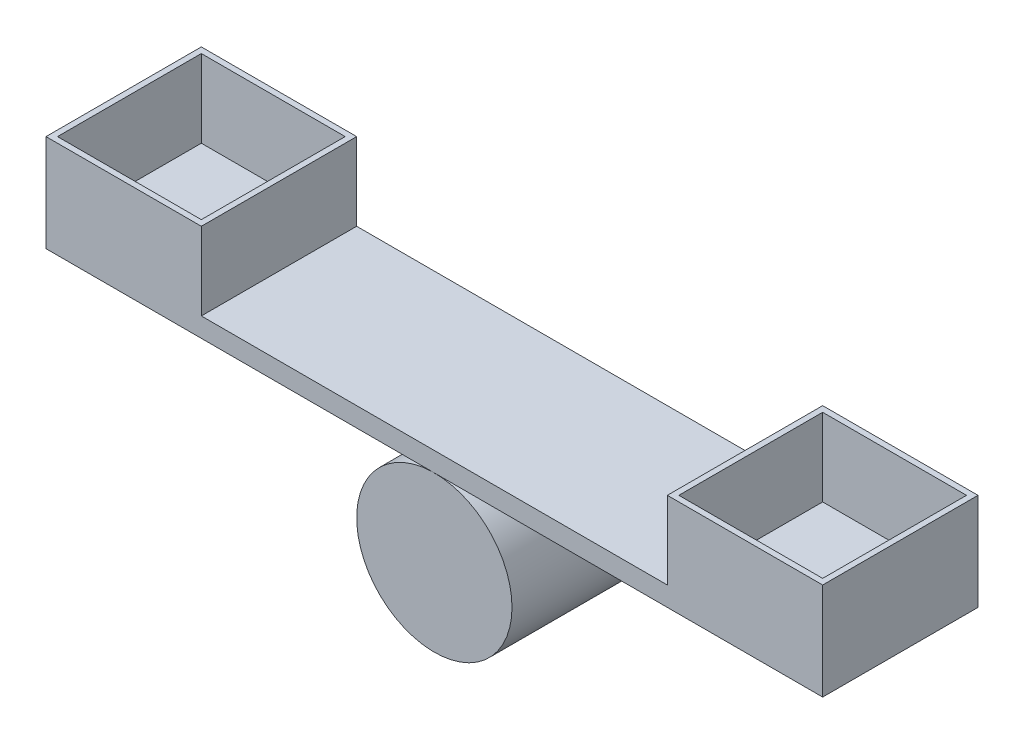
ISO-10303-21;
HEADER;
FILE_DESCRIPTION(('STEP AP214'),'2;1');
FILE_NAME('part.step','',(''),(''),'','','');
FILE_SCHEMA(('AUTOMOTIVE_DESIGN { 1 0 10303 214 1 1 1 1 }'));
ENDSEC;
DATA;
#1=APPLICATION_CONTEXT('core data for automotive mechanical design processes');
#2=APPLICATION_PROTOCOL_DEFINITION('international standard','automotive_design',2000,#1);
#3=PRODUCT_CONTEXT('',#1,'mechanical');
#4=PRODUCT('Part','Part','',(#3));
#5=PRODUCT_RELATED_PRODUCT_CATEGORY('part','',(#4));
#6=PRODUCT_DEFINITION_FORMATION('','',#4);
#7=PRODUCT_DEFINITION_CONTEXT('part definition',#1,'design');
#8=PRODUCT_DEFINITION('design','',#6,#7);
#9=PRODUCT_DEFINITION_SHAPE('','',#8);
#10=(LENGTH_UNIT() NAMED_UNIT(*) SI_UNIT(.MILLI.,.METRE.));
#11=(NAMED_UNIT(*) PLANE_ANGLE_UNIT() SI_UNIT($,.RADIAN.));
#12=(NAMED_UNIT(*) SI_UNIT($,.STERADIAN.) SOLID_ANGLE_UNIT());
#13=UNCERTAINTY_MEASURE_WITH_UNIT(LENGTH_MEASURE(1.E-05),#10,'distance_accuracy_value','');
#14=(GEOMETRIC_REPRESENTATION_CONTEXT(3) GLOBAL_UNCERTAINTY_ASSIGNED_CONTEXT((#13)) GLOBAL_UNIT_ASSIGNED_CONTEXT((#10,
#11,#12)) REPRESENTATION_CONTEXT('',''));
#15=CARTESIAN_POINT('',(0.,0.,0.));
#16=DIRECTION('',(0.,0.,1.));
#17=DIRECTION('',(1.,0.,0.));
#18=AXIS2_PLACEMENT_3D('',#15,#16,#17);
#19=CARTESIAN_POINT('',(0.,0.,101.6));
#20=DIRECTION('',(0.,0.,-1.));
#21=DIRECTION('',(-1.,0.,0.));
#22=AXIS2_PLACEMENT_3D('',#19,#20,#21);
#23=CYLINDRICAL_SURFACE('',#22,50.8);
#24=CARTESIAN_POINT('',(0.,0.,101.6));
#25=DIRECTION('',(0.,0.,1.));
#26=DIRECTION('',(1.,0.,0.));
#27=AXIS2_PLACEMENT_3D('',#24,#25,#26);
#28=CIRCLE('',#27,50.8);
#29=CARTESIAN_POINT('',(50.8,0.,101.6));
#30=VERTEX_POINT('',#29);
#31=EDGE_CURVE('E12',#30,#30,#28,.T.);
#32=ORIENTED_EDGE('',*,*,#31,.F.);
#33=EDGE_LOOP('',(#32));
#34=FACE_BOUND('',#33,.T.);
#35=CARTESIAN_POINT('',(0.,0.,0.));
#36=DIRECTION('',(0.,0.,1.));
#37=DIRECTION('',(1.,0.,0.));
#38=AXIS2_PLACEMENT_3D('',#35,#36,#37);
#39=CIRCLE('',#38,50.8);
#40=CARTESIAN_POINT('',(50.8,0.,0.));
#41=VERTEX_POINT('',#40);
#42=EDGE_CURVE('E65',#41,#41,#39,.T.);
#43=ORIENTED_EDGE('',*,*,#42,.T.);
#44=EDGE_LOOP('',(#43));
#45=FACE_BOUND('',#44,.T.);
#46=ADVANCED_FACE('F62',(#34,#45),#23,.T.);
#47=CARTESIAN_POINT('',(0.,0.,101.6));
#48=DIRECTION('',(0.,0.,1.));
#49=DIRECTION('',(1.,0.,0.));
#50=AXIS2_PLACEMENT_3D('',#47,#48,#49);
#51=PLANE('',#50);
#52=ORIENTED_EDGE('',*,*,#31,.T.);
#53=EDGE_LOOP('',(#52));
#54=FACE_BOUND('',#53,.T.);
#55=ADVANCED_FACE('F79',(#54),#51,.T.);
#56=CARTESIAN_POINT('',(0.,0.,0.));
#57=DIRECTION('',(0.,0.,1.));
#58=DIRECTION('',(1.,0.,0.));
#59=AXIS2_PLACEMENT_3D('',#56,#57,#58);
#60=PLANE('',#59);
#61=ORIENTED_EDGE('',*,*,#42,.F.);
#62=EDGE_LOOP('',(#61));
#63=FACE_BOUND('',#62,.T.);
#64=ADVANCED_FACE('F77',(#63),#60,.F.);
#65=CLOSED_SHELL('',(#46,#55,#64));
#66=MANIFOLD_SOLID_BREP('B2',#65);
#67=CARTESIAN_POINT('',(0.,63.5,101.6));
#68=DIRECTION('',(0.,-1.,0.));
#69=DIRECTION('',(1.,0.,0.));
#70=AXIS2_PLACEMENT_3D('',#67,#68,#69);
#71=PLANE('',#70);
#72=DIRECTION('',(0.,0.,1.));
#73=VECTOR('',#72,1.);
#74=CARTESIAN_POINT('',(152.4,63.5,101.6));
#75=LINE('',#74,#73);
#76=CARTESIAN_POINT('',(152.4,63.5,0.));
#77=VERTEX_POINT('',#76);
#78=CARTESIAN_POINT('',(152.4,63.5,101.6));
#79=VERTEX_POINT('',#78);
#80=EDGE_CURVE('E236',#77,#79,#75,.T.);
#81=ORIENTED_EDGE('',*,*,#80,.F.);
#82=DIRECTION('',(-1.,0.,0.));
#83=VECTOR('',#82,1.);
#84=CARTESIAN_POINT('',(0.,63.5,0.));
#85=LINE('',#84,#83);
#86=CARTESIAN_POINT('',(-152.4,63.5,0.));
#87=VERTEX_POINT('',#86);
#88=EDGE_CURVE('E334',#77,#87,#85,.T.);
#89=ORIENTED_EDGE('',*,*,#88,.T.);
#90=DIRECTION('',(0.,0.,-1.));
#91=VECTOR('',#90,1.);
#92=CARTESIAN_POINT('',(-152.4,63.5,0.));
#93=LINE('',#92,#91);
#94=CARTESIAN_POINT('',(-152.4,63.5,101.6));
#95=VERTEX_POINT('',#94);
#96=EDGE_CURVE('E310',#95,#87,#93,.T.);
#97=ORIENTED_EDGE('',*,*,#96,.F.);
#98=DIRECTION('',(-1.,0.,0.));
#99=VECTOR('',#98,1.);
#100=CARTESIAN_POINT('',(0.,63.5,101.6));
#101=LINE('',#100,#99);
#102=EDGE_CURVE('E128',#79,#95,#101,.T.);
#103=ORIENTED_EDGE('',*,*,#102,.F.);
#104=EDGE_LOOP('',(#81,#89,#97,#103));
#105=FACE_BOUND('',#104,.T.);
#106=ADVANCED_FACE('F105',(#105),#71,.F.);
#107=CARTESIAN_POINT('',(-254.,0.,101.6));
#108=DIRECTION('',(1.,0.,0.));
#109=DIRECTION('',(0.,0.,-1.));
#110=AXIS2_PLACEMENT_3D('',#107,#108,#109);
#111=PLANE('',#110);
#112=DIRECTION('',(0.,-1.,0.));
#113=VECTOR('',#112,1.);
#114=CARTESIAN_POINT('',(-254.,0.,0.));
#115=LINE('',#114,#113);
#116=CARTESIAN_POINT('',(-254.,114.3,0.));
#117=VERTEX_POINT('',#116);
#118=CARTESIAN_POINT('',(-254.,50.7999999999999,0.));
#119=VERTEX_POINT('',#118);
#120=EDGE_CURVE('E329',#117,#119,#115,.T.);
#121=ORIENTED_EDGE('',*,*,#120,.T.);
#122=DIRECTION('',(0.,0.,-1.));
#123=VECTOR('',#122,1.);
#124=CARTESIAN_POINT('',(-254.,50.7999999999999,101.6));
#125=LINE('',#124,#123);
#126=CARTESIAN_POINT('',(-254.,50.7999999999999,101.6));
#127=VERTEX_POINT('',#126);
#128=EDGE_CURVE('E60',#127,#119,#125,.T.);
#129=ORIENTED_EDGE('',*,*,#128,.F.);
#130=DIRECTION('',(0.,-1.,0.));
#131=VECTOR('',#130,1.);
#132=CARTESIAN_POINT('',(-254.,0.,101.6));
#133=LINE('',#132,#131);
#134=CARTESIAN_POINT('',(-254.,114.3,101.6));
#135=VERTEX_POINT('',#134);
#136=EDGE_CURVE('E330',#135,#127,#133,.T.);
#137=ORIENTED_EDGE('',*,*,#136,.F.);
#138=DIRECTION('',(0.,0.,1.));
#139=VECTOR('',#138,1.);
#140=CARTESIAN_POINT('',(-254.,114.3,101.6));
#141=LINE('',#140,#139);
#142=EDGE_CURVE('E311',#117,#135,#141,.T.);
#143=ORIENTED_EDGE('',*,*,#142,.F.);
#144=EDGE_LOOP('',(#121,#129,#137,#143));
#145=FACE_BOUND('',#144,.T.);
#146=ADVANCED_FACE('F107',(#145),#111,.F.);
#147=CARTESIAN_POINT('',(0.,50.8,101.6));
#148=DIRECTION('',(0.,1.,0.));
#149=DIRECTION('',(-1.,0.,0.));
#150=AXIS2_PLACEMENT_3D('',#147,#148,#149);
#151=PLANE('',#150);
#152=DIRECTION('',(1.,0.,0.));
#153=VECTOR('',#152,1.);
#154=CARTESIAN_POINT('',(0.,50.8,0.));
#155=LINE('',#154,#153);
#156=CARTESIAN_POINT('',(254.,50.8,0.));
#157=VERTEX_POINT('',#156);
#158=EDGE_CURVE('E341',#119,#157,#155,.T.);
#159=ORIENTED_EDGE('',*,*,#158,.T.);
#160=DIRECTION('',(0.,0.,-1.));
#161=VECTOR('',#160,1.);
#162=CARTESIAN_POINT('',(254.,50.8,101.6));
#163=LINE('',#162,#161);
#164=CARTESIAN_POINT('',(254.,50.8,101.6));
#165=VERTEX_POINT('',#164);
#166=EDGE_CURVE('E113',#165,#157,#163,.T.);
#167=ORIENTED_EDGE('',*,*,#166,.F.);
#168=DIRECTION('',(1.,0.,0.));
#169=VECTOR('',#168,1.);
#170=CARTESIAN_POINT('',(0.,50.8,101.6));
#171=LINE('',#170,#169);
#172=EDGE_CURVE('E333',#127,#165,#171,.T.);
#173=ORIENTED_EDGE('',*,*,#172,.F.);
#174=ORIENTED_EDGE('',*,*,#128,.T.);
#175=EDGE_LOOP('',(#159,#167,#173,#174));
#176=FACE_BOUND('',#175,.T.);
#177=ADVANCED_FACE('F364',(#176),#151,.F.);
#178=CARTESIAN_POINT('',(254.,0.,101.6));
#179=DIRECTION('',(-1.,0.,0.));
#180=DIRECTION('',(0.,0.,1.));
#181=AXIS2_PLACEMENT_3D('',#178,#179,#180);
#182=PLANE('',#181);
#183=DIRECTION('',(0.,1.,0.));
#184=VECTOR('',#183,1.);
#185=CARTESIAN_POINT('',(254.,0.,0.));
#186=LINE('',#185,#184);
#187=CARTESIAN_POINT('',(254.,114.3,0.));
#188=VERTEX_POINT('',#187);
#189=EDGE_CURVE('E343',#157,#188,#186,.T.);
#190=ORIENTED_EDGE('',*,*,#189,.T.);
#191=DIRECTION('',(0.,0.,-1.));
#192=VECTOR('',#191,1.);
#193=CARTESIAN_POINT('',(254.,114.3,0.));
#194=LINE('',#193,#192);
#195=CARTESIAN_POINT('',(254.,114.3,101.6));
#196=VERTEX_POINT('',#195);
#197=EDGE_CURVE('E268',#196,#188,#194,.T.);
#198=ORIENTED_EDGE('',*,*,#197,.F.);
#199=DIRECTION('',(0.,1.,0.));
#200=VECTOR('',#199,1.);
#201=CARTESIAN_POINT('',(254.,0.,101.6));
#202=LINE('',#201,#200);
#203=EDGE_CURVE('E336',#165,#196,#202,.T.);
#204=ORIENTED_EDGE('',*,*,#203,.F.);
#205=ORIENTED_EDGE('',*,*,#166,.T.);
#206=EDGE_LOOP('',(#190,#198,#204,#205));
#207=FACE_BOUND('',#206,.T.);
#208=ADVANCED_FACE('F350',(#207),#182,.F.);
#209=CARTESIAN_POINT('',(0.,0.,101.6));
#210=DIRECTION('',(0.,0.,1.));
#211=DIRECTION('',(1.,0.,0.));
#212=AXIS2_PLACEMENT_3D('',#209,#210,#211);
#213=PLANE('',#212);
#214=ORIENTED_EDGE('',*,*,#136,.T.);
#215=ORIENTED_EDGE('',*,*,#172,.T.);
#216=ORIENTED_EDGE('',*,*,#203,.T.);
#217=DIRECTION('',(1.,0.,0.));
#218=VECTOR('',#217,1.);
#219=CARTESIAN_POINT('',(254.,114.3,101.6));
#220=LINE('',#219,#218);
#221=CARTESIAN_POINT('',(152.4,114.3,101.6));
#222=VERTEX_POINT('',#221);
#223=EDGE_CURVE('E265',#222,#196,#220,.T.);
#224=ORIENTED_EDGE('',*,*,#223,.F.);
#225=DIRECTION('',(0.,-1.,0.));
#226=VECTOR('',#225,1.);
#227=CARTESIAN_POINT('',(152.4,114.3,101.6));
#228=LINE('',#227,#226);
#229=EDGE_CURVE('E271',#222,#79,#228,.T.);
#230=ORIENTED_EDGE('',*,*,#229,.T.);
#231=ORIENTED_EDGE('',*,*,#102,.T.);
#232=DIRECTION('',(0.,-1.,0.));
#233=VECTOR('',#232,1.);
#234=CARTESIAN_POINT('',(-152.4,114.3,101.6));
#235=LINE('',#234,#233);
#236=CARTESIAN_POINT('',(-152.4,114.3,101.6));
#237=VERTEX_POINT('',#236);
#238=EDGE_CURVE('E326',#237,#95,#235,.T.);
#239=ORIENTED_EDGE('',*,*,#238,.F.);
#240=DIRECTION('',(1.,0.,0.));
#241=VECTOR('',#240,1.);
#242=CARTESIAN_POINT('',(-152.4,114.3,101.6));
#243=LINE('',#242,#241);
#244=EDGE_CURVE('E314',#135,#237,#243,.T.);
#245=ORIENTED_EDGE('',*,*,#244,.F.);
#246=EDGE_LOOP('',(#214,#215,#216,#224,#230,#231,#239,#245));
#247=FACE_BOUND('',#246,.T.);
#248=ADVANCED_FACE('F361',(#247),#213,.T.);
#249=CARTESIAN_POINT('',(0.,0.,0.));
#250=DIRECTION('',(0.,0.,1.));
#251=DIRECTION('',(1.,0.,0.));
#252=AXIS2_PLACEMENT_3D('',#249,#250,#251);
#253=PLANE('',#252);
#254=ORIENTED_EDGE('',*,*,#120,.F.);
#255=DIRECTION('',(-1.,0.,0.));
#256=VECTOR('',#255,1.);
#257=CARTESIAN_POINT('',(-254.,114.3,0.));
#258=LINE('',#257,#256);
#259=CARTESIAN_POINT('',(-152.4,114.3,0.));
#260=VERTEX_POINT('',#259);
#261=EDGE_CURVE('E318',#260,#117,#258,.T.);
#262=ORIENTED_EDGE('',*,*,#261,.F.);
#263=DIRECTION('',(0.,-1.,0.));
#264=VECTOR('',#263,1.);
#265=CARTESIAN_POINT('',(-152.4,114.3,0.));
#266=LINE('',#265,#264);
#267=EDGE_CURVE('E321',#260,#87,#266,.T.);
#268=ORIENTED_EDGE('',*,*,#267,.T.);
#269=ORIENTED_EDGE('',*,*,#88,.F.);
#270=DIRECTION('',(0.,-1.,0.));
#271=VECTOR('',#270,1.);
#272=CARTESIAN_POINT('',(152.4,114.3,0.));
#273=LINE('',#272,#271);
#274=CARTESIAN_POINT('',(152.4,114.3,0.));
#275=VERTEX_POINT('',#274);
#276=EDGE_CURVE('E275',#275,#77,#273,.T.);
#277=ORIENTED_EDGE('',*,*,#276,.F.);
#278=DIRECTION('',(-1.,0.,0.));
#279=VECTOR('',#278,1.);
#280=CARTESIAN_POINT('',(152.4,114.3,0.));
#281=LINE('',#280,#279);
#282=EDGE_CURVE('E260',#188,#275,#281,.T.);
#283=ORIENTED_EDGE('',*,*,#282,.F.);
#284=ORIENTED_EDGE('',*,*,#189,.F.);
#285=ORIENTED_EDGE('',*,*,#158,.F.);
#286=EDGE_LOOP('',(#254,#262,#268,#269,#277,#283,#284,#285));
#287=FACE_BOUND('',#286,.T.);
#288=ADVANCED_FACE('F355',(#287),#253,.F.);
#289=CARTESIAN_POINT('',(0.,114.3,0.));
#290=DIRECTION('',(0.,-1.,0.));
#291=DIRECTION('',(1.,0.,0.));
#292=AXIS2_PLACEMENT_3D('',#289,#290,#291);
#293=PLANE('',#292);
#294=ORIENTED_EDGE('',*,*,#142,.T.);
#295=ORIENTED_EDGE('',*,*,#244,.T.);
#296=DIRECTION('',(0.,0.,-1.));
#297=VECTOR('',#296,1.);
#298=CARTESIAN_POINT('',(-152.4,114.3,0.));
#299=LINE('',#298,#297);
#300=EDGE_CURVE('E316',#237,#260,#299,.T.);
#301=ORIENTED_EDGE('',*,*,#300,.T.);
#302=ORIENTED_EDGE('',*,*,#261,.T.);
#303=EDGE_LOOP('',(#294,#295,#301,#302));
#304=FACE_BOUND('',#303,.T.);
#305=DIRECTION('',(0.,0.,1.));
#306=VECTOR('',#305,1.);
#307=CARTESIAN_POINT('',(-250.24270790924,114.3,97.8427079092401));
#308=LINE('',#307,#306);
#309=CARTESIAN_POINT('',(-250.24270790924,114.3,3.75729209075987));
#310=VERTEX_POINT('',#309);
#311=CARTESIAN_POINT('',(-250.24270790924,114.3,97.8427079092401));
#312=VERTEX_POINT('',#311);
#313=EDGE_CURVE('E279',#310,#312,#308,.T.);
#314=ORIENTED_EDGE('',*,*,#313,.F.);
#315=DIRECTION('',(-1.,0.,0.));
#316=VECTOR('',#315,1.);
#317=CARTESIAN_POINT('',(-250.24270790924,114.3,3.75729209075987));
#318=LINE('',#317,#316);
#319=CARTESIAN_POINT('',(-156.15729209076,114.3,3.75729209075987));
#320=VERTEX_POINT('',#319);
#321=EDGE_CURVE('E287',#320,#310,#318,.T.);
#322=ORIENTED_EDGE('',*,*,#321,.F.);
#323=DIRECTION('',(0.,0.,-1.));
#324=VECTOR('',#323,1.);
#325=CARTESIAN_POINT('',(-156.15729209076,114.3,3.75729209075987));
#326=LINE('',#325,#324);
#327=CARTESIAN_POINT('',(-156.15729209076,114.3,97.8427079092401));
#328=VERTEX_POINT('',#327);
#329=EDGE_CURVE('E284',#328,#320,#326,.T.);
#330=ORIENTED_EDGE('',*,*,#329,.F.);
#331=DIRECTION('',(1.,0.,0.));
#332=VECTOR('',#331,1.);
#333=CARTESIAN_POINT('',(-156.15729209076,114.3,97.8427079092401));
#334=LINE('',#333,#332);
#335=EDGE_CURVE('E281',#312,#328,#334,.T.);
#336=ORIENTED_EDGE('',*,*,#335,.F.);
#337=EDGE_LOOP('',(#314,#322,#330,#336));
#338=FACE_BOUND('',#337,.T.);
#339=ADVANCED_FACE('F369',(#304,#338),#293,.F.);
#340=CARTESIAN_POINT('',(-152.4,114.3,0.));
#341=DIRECTION('',(-1.,0.,0.));
#342=DIRECTION('',(0.,0.,1.));
#343=AXIS2_PLACEMENT_3D('',#340,#341,#342);
#344=PLANE('',#343);
#345=ORIENTED_EDGE('',*,*,#96,.T.);
#346=ORIENTED_EDGE('',*,*,#267,.F.);
#347=ORIENTED_EDGE('',*,*,#300,.F.);
#348=ORIENTED_EDGE('',*,*,#238,.T.);
#349=EDGE_LOOP('',(#345,#346,#347,#348));
#350=FACE_BOUND('',#349,.T.);
#351=ADVANCED_FACE('F375',(#350),#344,.F.);
#352=CARTESIAN_POINT('',(-250.24270790924,114.3,97.8427079092401));
#353=DIRECTION('',(1.,0.,0.));
#354=DIRECTION('',(0.,1.,0.));
#355=AXIS2_PLACEMENT_3D('',#352,#353,#354);
#356=PLANE('',#355);
#357=DIRECTION('',(0.,0.,1.));
#358=VECTOR('',#357,1.);
#359=CARTESIAN_POINT('',(-250.24270790924,63.4999999999999,97.8427079092401));
#360=LINE('',#359,#358);
#361=CARTESIAN_POINT('',(-250.24270790924,63.4999999999999,3.75729209075987));
#362=VERTEX_POINT('',#361);
#363=CARTESIAN_POINT('',(-250.24270790924,63.4999999999999,97.8427079092401));
#364=VERTEX_POINT('',#363);
#365=EDGE_CURVE('E278',#362,#364,#360,.T.);
#366=ORIENTED_EDGE('',*,*,#365,.F.);
#367=DIRECTION('',(0.,-1.,0.));
#368=VECTOR('',#367,1.);
#369=CARTESIAN_POINT('',(-250.24270790924,114.3,3.75729209075987));
#370=LINE('',#369,#368);
#371=EDGE_CURVE('E289',#310,#362,#370,.T.);
#372=ORIENTED_EDGE('',*,*,#371,.F.);
#373=ORIENTED_EDGE('',*,*,#313,.T.);
#374=DIRECTION('',(0.,-1.,0.));
#375=VECTOR('',#374,1.);
#376=CARTESIAN_POINT('',(-250.24270790924,114.3,97.8427079092401));
#377=LINE('',#376,#375);
#378=EDGE_CURVE('E307',#312,#364,#377,.T.);
#379=ORIENTED_EDGE('',*,*,#378,.T.);
#380=EDGE_LOOP('',(#366,#372,#373,#379));
#381=FACE_BOUND('',#380,.T.);
#382=ADVANCED_FACE('F415',(#381),#356,.T.);
#383=CARTESIAN_POINT('',(-156.15729209076,114.3,97.8427079092401));
#384=DIRECTION('',(0.,0.,-1.));
#385=DIRECTION('',(-1.,0.,0.));
#386=AXIS2_PLACEMENT_3D('',#383,#384,#385);
#387=PLANE('',#386);
#388=DIRECTION('',(1.,0.,0.));
#389=VECTOR('',#388,1.);
#390=CARTESIAN_POINT('',(-156.15729209076,63.5,97.8427079092401));
#391=LINE('',#390,#389);
#392=CARTESIAN_POINT('',(-156.15729209076,63.5,97.8427079092401));
#393=VERTEX_POINT('',#392);
#394=EDGE_CURVE('E292',#364,#393,#391,.T.);
#395=ORIENTED_EDGE('',*,*,#394,.F.);
#396=ORIENTED_EDGE('',*,*,#378,.F.);
#397=ORIENTED_EDGE('',*,*,#335,.T.);
#398=DIRECTION('',(0.,-1.,0.));
#399=VECTOR('',#398,1.);
#400=CARTESIAN_POINT('',(-156.15729209076,114.3,97.8427079092401));
#401=LINE('',#400,#399);
#402=EDGE_CURVE('E305',#328,#393,#401,.T.);
#403=ORIENTED_EDGE('',*,*,#402,.T.);
#404=EDGE_LOOP('',(#395,#396,#397,#403));
#405=FACE_BOUND('',#404,.T.);
#406=ADVANCED_FACE('F419',(#405),#387,.T.);
#407=CARTESIAN_POINT('',(-156.15729209076,114.3,3.75729209075987));
#408=DIRECTION('',(-1.,0.,0.));
#409=DIRECTION('',(0.,0.,1.));
#410=AXIS2_PLACEMENT_3D('',#407,#408,#409);
#411=PLANE('',#410);
#412=DIRECTION('',(0.,0.,-1.));
#413=VECTOR('',#412,1.);
#414=CARTESIAN_POINT('',(-156.15729209076,63.5,3.75729209075987));
#415=LINE('',#414,#413);
#416=CARTESIAN_POINT('',(-156.15729209076,63.5,3.75729209075987));
#417=VERTEX_POINT('',#416);
#418=EDGE_CURVE('E295',#393,#417,#415,.T.);
#419=ORIENTED_EDGE('',*,*,#418,.F.);
#420=ORIENTED_EDGE('',*,*,#402,.F.);
#421=ORIENTED_EDGE('',*,*,#329,.T.);
#422=DIRECTION('',(0.,-1.,0.));
#423=VECTOR('',#422,1.);
#424=CARTESIAN_POINT('',(-156.15729209076,114.3,3.75729209075987));
#425=LINE('',#424,#423);
#426=EDGE_CURVE('E302',#320,#417,#425,.T.);
#427=ORIENTED_EDGE('',*,*,#426,.T.);
#428=EDGE_LOOP('',(#419,#420,#421,#427));
#429=FACE_BOUND('',#428,.T.);
#430=ADVANCED_FACE('F405',(#429),#411,.T.);
#431=CARTESIAN_POINT('',(-250.24270790924,114.3,3.75729209075987));
#432=DIRECTION('',(0.,0.,1.));
#433=DIRECTION('',(1.,0.,0.));
#434=AXIS2_PLACEMENT_3D('',#431,#432,#433);
#435=PLANE('',#434);
#436=DIRECTION('',(-1.,0.,0.));
#437=VECTOR('',#436,1.);
#438=CARTESIAN_POINT('',(-250.24270790924,63.4999999999999,3.75729209075987));
#439=LINE('',#438,#437);
#440=EDGE_CURVE('E282',#417,#362,#439,.T.);
#441=ORIENTED_EDGE('',*,*,#440,.F.);
#442=ORIENTED_EDGE('',*,*,#426,.F.);
#443=ORIENTED_EDGE('',*,*,#321,.T.);
#444=ORIENTED_EDGE('',*,*,#371,.T.);
#445=EDGE_LOOP('',(#441,#442,#443,#444));
#446=FACE_BOUND('',#445,.T.);
#447=ADVANCED_FACE('F400',(#446),#435,.T.);
#448=ORIENTED_EDGE('',*,*,#418,.T.);
#449=ORIENTED_EDGE('',*,*,#440,.T.);
#450=ORIENTED_EDGE('',*,*,#365,.T.);
#451=ORIENTED_EDGE('',*,*,#394,.T.);
#452=EDGE_LOOP('',(#448,#449,#450,#451));
#453=FACE_BOUND('',#452,.T.);
#454=ADVANCED_FACE('F385',(#453),#71,.F.);
#455=CARTESIAN_POINT('',(0.,114.3,0.));
#456=DIRECTION('',(0.,-1.,0.));
#457=DIRECTION('',(1.,0.,0.));
#458=AXIS2_PLACEMENT_3D('',#455,#456,#457);
#459=PLANE('',#458);
#460=ORIENTED_EDGE('',*,*,#282,.T.);
#461=DIRECTION('',(0.,0.,1.));
#462=VECTOR('',#461,1.);
#463=CARTESIAN_POINT('',(152.4,114.3,101.6));
#464=LINE('',#463,#462);
#465=EDGE_CURVE('E263',#275,#222,#464,.T.);
#466=ORIENTED_EDGE('',*,*,#465,.T.);
#467=ORIENTED_EDGE('',*,*,#223,.T.);
#468=ORIENTED_EDGE('',*,*,#197,.T.);
#469=EDGE_LOOP('',(#460,#466,#467,#468));
#470=FACE_BOUND('',#469,.T.);
#471=DIRECTION('',(-1.,0.,0.));
#472=VECTOR('',#471,1.);
#473=CARTESIAN_POINT('',(156.15729209076,114.3,3.75729209075989));
#474=LINE('',#473,#472);
#475=CARTESIAN_POINT('',(250.24270790924,114.3,3.75729209075989));
#476=VERTEX_POINT('',#475);
#477=CARTESIAN_POINT('',(156.15729209076,114.3,3.75729209075989));
#478=VERTEX_POINT('',#477);
#479=EDGE_CURVE('E220',#476,#478,#474,.T.);
#480=ORIENTED_EDGE('',*,*,#479,.F.);
#481=DIRECTION('',(0.,0.,-1.));
#482=VECTOR('',#481,1.);
#483=CARTESIAN_POINT('',(250.24270790924,114.3,3.75729209075989));
#484=LINE('',#483,#482);
#485=CARTESIAN_POINT('',(250.24270790924,114.3,97.8427079092401));
#486=VERTEX_POINT('',#485);
#487=EDGE_CURVE('E244',#486,#476,#484,.T.);
#488=ORIENTED_EDGE('',*,*,#487,.F.);
#489=DIRECTION('',(1.,0.,0.));
#490=VECTOR('',#489,1.);
#491=CARTESIAN_POINT('',(250.24270790924,114.3,97.8427079092401));
#492=LINE('',#491,#490);
#493=CARTESIAN_POINT('',(156.15729209076,114.3,97.8427079092401));
#494=VERTEX_POINT('',#493);
#495=EDGE_CURVE('E242',#494,#486,#492,.T.);
#496=ORIENTED_EDGE('',*,*,#495,.F.);
#497=DIRECTION('',(0.,0.,1.));
#498=VECTOR('',#497,1.);
#499=CARTESIAN_POINT('',(156.15729209076,114.3,97.8427079092401));
#500=LINE('',#499,#498);
#501=EDGE_CURVE('E228',#478,#494,#500,.T.);
#502=ORIENTED_EDGE('',*,*,#501,.F.);
#503=EDGE_LOOP('',(#480,#488,#496,#502));
#504=FACE_BOUND('',#503,.T.);
#505=ADVANCED_FACE('F240',(#470,#504),#459,.F.);
#506=CARTESIAN_POINT('',(152.4,114.3,101.6));
#507=DIRECTION('',(1.,0.,0.));
#508=DIRECTION('',(0.,1.,0.));
#509=AXIS2_PLACEMENT_3D('',#506,#507,#508);
#510=PLANE('',#509);
#511=ORIENTED_EDGE('',*,*,#80,.T.);
#512=ORIENTED_EDGE('',*,*,#229,.F.);
#513=ORIENTED_EDGE('',*,*,#465,.F.);
#514=ORIENTED_EDGE('',*,*,#276,.T.);
#515=EDGE_LOOP('',(#511,#512,#513,#514));
#516=FACE_BOUND('',#515,.T.);
#517=ADVANCED_FACE('F377',(#516),#510,.F.);
#518=CARTESIAN_POINT('',(156.15729209076,114.3,3.75729209075989));
#519=DIRECTION('',(0.,0.,1.));
#520=DIRECTION('',(1.,0.,0.));
#521=AXIS2_PLACEMENT_3D('',#518,#519,#520);
#522=PLANE('',#521);
#523=DIRECTION('',(-1.,0.,0.));
#524=VECTOR('',#523,1.);
#525=CARTESIAN_POINT('',(156.15729209076,63.5,3.75729209075989));
#526=LINE('',#525,#524);
#527=CARTESIAN_POINT('',(250.24270790924,63.5,3.7572920907599));
#528=VERTEX_POINT('',#527);
#529=CARTESIAN_POINT('',(156.15729209076,63.5,3.75729209075989));
#530=VERTEX_POINT('',#529);
#531=EDGE_CURVE('E248',#528,#530,#526,.T.);
#532=ORIENTED_EDGE('',*,*,#531,.F.);
#533=DIRECTION('',(0.,-1.,0.));
#534=VECTOR('',#533,1.);
#535=CARTESIAN_POINT('',(250.24270790924,114.3,3.75729209075989));
#536=LINE('',#535,#534);
#537=EDGE_CURVE('E120',#476,#528,#536,.T.);
#538=ORIENTED_EDGE('',*,*,#537,.F.);
#539=ORIENTED_EDGE('',*,*,#479,.T.);
#540=DIRECTION('',(0.,-1.,0.));
#541=VECTOR('',#540,1.);
#542=CARTESIAN_POINT('',(156.15729209076,114.3,3.75729209075989));
#543=LINE('',#542,#541);
#544=EDGE_CURVE('E223',#478,#530,#543,.T.);
#545=ORIENTED_EDGE('',*,*,#544,.T.);
#546=EDGE_LOOP('',(#532,#538,#539,#545));
#547=FACE_BOUND('',#546,.T.);
#548=ADVANCED_FACE('F222',(#547),#522,.T.);
#549=CARTESIAN_POINT('',(156.15729209076,114.3,97.8427079092401));
#550=DIRECTION('',(1.,0.,0.));
#551=DIRECTION('',(0.,1.,0.));
#552=AXIS2_PLACEMENT_3D('',#549,#550,#551);
#553=PLANE('',#552);
#554=DIRECTION('',(0.,0.,1.));
#555=VECTOR('',#554,1.);
#556=CARTESIAN_POINT('',(156.15729209076,63.5,97.8427079092401));
#557=LINE('',#556,#555);
#558=CARTESIAN_POINT('',(156.15729209076,63.5,97.8427079092401));
#559=VERTEX_POINT('',#558);
#560=EDGE_CURVE('E235',#530,#559,#557,.T.);
#561=ORIENTED_EDGE('',*,*,#560,.F.);
#562=ORIENTED_EDGE('',*,*,#544,.F.);
#563=ORIENTED_EDGE('',*,*,#501,.T.);
#564=DIRECTION('',(0.,-1.,0.));
#565=VECTOR('',#564,1.);
#566=CARTESIAN_POINT('',(156.15729209076,114.3,97.8427079092401));
#567=LINE('',#566,#565);
#568=EDGE_CURVE('E237',#494,#559,#567,.T.);
#569=ORIENTED_EDGE('',*,*,#568,.T.);
#570=EDGE_LOOP('',(#561,#562,#563,#569));
#571=FACE_BOUND('',#570,.T.);
#572=ADVANCED_FACE('F232',(#571),#553,.T.);
#573=CARTESIAN_POINT('',(250.24270790924,114.3,97.8427079092401));
#574=DIRECTION('',(0.,0.,-1.));
#575=DIRECTION('',(-1.,0.,0.));
#576=AXIS2_PLACEMENT_3D('',#573,#574,#575);
#577=PLANE('',#576);
#578=DIRECTION('',(1.,0.,0.));
#579=VECTOR('',#578,1.);
#580=CARTESIAN_POINT('',(250.24270790924,63.5,97.8427079092401));
#581=LINE('',#580,#579);
#582=CARTESIAN_POINT('',(250.24270790924,63.5,97.8427079092401));
#583=VERTEX_POINT('',#582);
#584=EDGE_CURVE('E251',#559,#583,#581,.T.);
#585=ORIENTED_EDGE('',*,*,#584,.F.);
#586=ORIENTED_EDGE('',*,*,#568,.F.);
#587=ORIENTED_EDGE('',*,*,#495,.T.);
#588=DIRECTION('',(0.,-1.,0.));
#589=VECTOR('',#588,1.);
#590=CARTESIAN_POINT('',(250.24270790924,114.3,97.8427079092401));
#591=LINE('',#590,#589);
#592=EDGE_CURVE('E257',#486,#583,#591,.T.);
#593=ORIENTED_EDGE('',*,*,#592,.T.);
#594=EDGE_LOOP('',(#585,#586,#587,#593));
#595=FACE_BOUND('',#594,.T.);
#596=ADVANCED_FACE('F499',(#595),#577,.T.);
#597=CARTESIAN_POINT('',(250.24270790924,114.3,3.75729209075989));
#598=DIRECTION('',(-1.,0.,0.));
#599=DIRECTION('',(0.,-1.,0.));
#600=AXIS2_PLACEMENT_3D('',#597,#598,#599);
#601=PLANE('',#600);
#602=DIRECTION('',(0.,0.,-1.));
#603=VECTOR('',#602,1.);
#604=CARTESIAN_POINT('',(250.24270790924,63.5,3.75729209075989));
#605=LINE('',#604,#603);
#606=EDGE_CURVE('E229',#583,#528,#605,.T.);
#607=ORIENTED_EDGE('',*,*,#606,.F.);
#608=ORIENTED_EDGE('',*,*,#592,.F.);
#609=ORIENTED_EDGE('',*,*,#487,.T.);
#610=ORIENTED_EDGE('',*,*,#537,.T.);
#611=EDGE_LOOP('',(#607,#608,#609,#610));
#612=FACE_BOUND('',#611,.T.);
#613=ADVANCED_FACE('F397',(#612),#601,.T.);
#614=ORIENTED_EDGE('',*,*,#606,.T.);
#615=ORIENTED_EDGE('',*,*,#531,.T.);
#616=ORIENTED_EDGE('',*,*,#560,.T.);
#617=ORIENTED_EDGE('',*,*,#584,.T.);
#618=EDGE_LOOP('',(#614,#615,#616,#617));
#619=FACE_BOUND('',#618,.T.);
#620=ADVANCED_FACE('F390',(#619),#71,.F.);
#621=CLOSED_SHELL('',(#106,#146,#177,#208,#248,#288,#339,#351,#382,#406,#430,#447,#454,#505,
#517,#548,#572,#596,#613,#620));
#622=MANIFOLD_SOLID_BREP('B7',#621);
#623=ADVANCED_BREP_SHAPE_REPRESENTATION('',(#18,#66,#622),#14);
#624=SHAPE_DEFINITION_REPRESENTATION(#9,#623);
ENDSEC;
END-ISO-10303-21;
